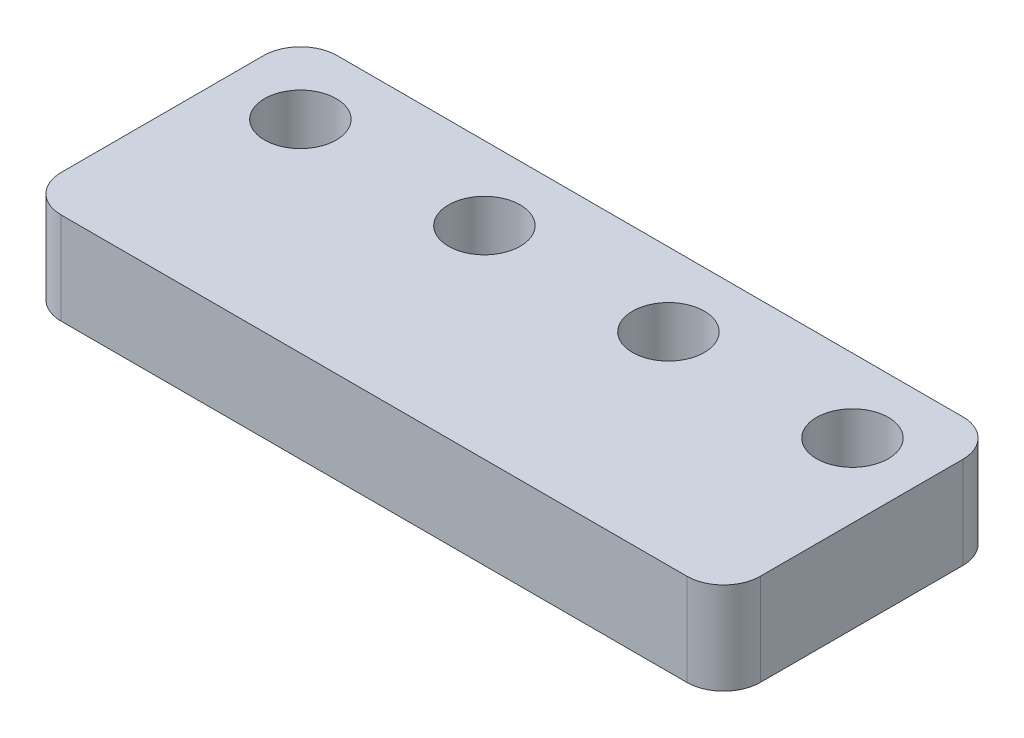
ISO-10303-21;
HEADER;
FILE_DESCRIPTION(('STEP AP214'),'2;1');
FILE_NAME('part.step','',(''),(''),'','','');
FILE_SCHEMA(('AUTOMOTIVE_DESIGN { 1 0 10303 214 1 1 1 1 }'));
ENDSEC;
DATA;
#1=APPLICATION_CONTEXT('core data for automotive mechanical design processes');
#2=APPLICATION_PROTOCOL_DEFINITION('international standard','automotive_design',2000,#1);
#3=PRODUCT_CONTEXT('',#1,'mechanical');
#4=PRODUCT('Part','Part','',(#3));
#5=PRODUCT_RELATED_PRODUCT_CATEGORY('part','',(#4));
#6=PRODUCT_DEFINITION_FORMATION('','',#4);
#7=PRODUCT_DEFINITION_CONTEXT('part definition',#1,'design');
#8=PRODUCT_DEFINITION('design','',#6,#7);
#9=PRODUCT_DEFINITION_SHAPE('','',#8);
#10=(LENGTH_UNIT() NAMED_UNIT(*) SI_UNIT(.MILLI.,.METRE.));
#11=(NAMED_UNIT(*) PLANE_ANGLE_UNIT() SI_UNIT($,.RADIAN.));
#12=(NAMED_UNIT(*) SI_UNIT($,.STERADIAN.) SOLID_ANGLE_UNIT());
#13=UNCERTAINTY_MEASURE_WITH_UNIT(LENGTH_MEASURE(1.E-05),#10,'distance_accuracy_value','');
#14=(GEOMETRIC_REPRESENTATION_CONTEXT(3) GLOBAL_UNCERTAINTY_ASSIGNED_CONTEXT((#13)) GLOBAL_UNIT_ASSIGNED_CONTEXT((#10,
#11,#12)) REPRESENTATION_CONTEXT('',''));
#15=CARTESIAN_POINT('',(0.,0.,0.));
#16=DIRECTION('',(0.,0.,1.));
#17=DIRECTION('',(1.,0.,0.));
#18=AXIS2_PLACEMENT_3D('',#15,#16,#17);
#19=CARTESIAN_POINT('',(-2.,5.,13.));
#20=DIRECTION('',(0.,-1.,0.));
#21=DIRECTION('',(0.,0.,-1.));
#22=AXIS2_PLACEMENT_3D('',#19,#20,#21);
#23=CYLINDRICAL_SURFACE('',#22,2.);
#24=CARTESIAN_POINT('',(-2.,0.,13.));
#25=DIRECTION('',(0.,1.,0.));
#26=DIRECTION('',(0.,0.,1.));
#27=AXIS2_PLACEMENT_3D('',#24,#25,#26);
#28=CIRCLE('',#27,2.);
#29=CARTESIAN_POINT('',(-2.,0.,15.));
#30=VERTEX_POINT('',#29);
#31=CARTESIAN_POINT('',(0.,0.,13.));
#32=VERTEX_POINT('',#31);
#33=EDGE_CURVE('E129',#30,#32,#28,.T.);
#34=ORIENTED_EDGE('',*,*,#33,.T.);
#35=DIRECTION('',(0.,-1.,0.));
#36=VECTOR('',#35,1.);
#37=CARTESIAN_POINT('',(0.,5.,13.));
#38=LINE('',#37,#36);
#39=CARTESIAN_POINT('',(0.,5.,13.));
#40=VERTEX_POINT('',#39);
#41=EDGE_CURVE('E11',#40,#32,#38,.T.);
#42=ORIENTED_EDGE('',*,*,#41,.F.);
#43=CARTESIAN_POINT('',(-2.,5.,13.));
#44=DIRECTION('',(0.,1.,0.));
#45=DIRECTION('',(0.,0.,1.));
#46=AXIS2_PLACEMENT_3D('',#43,#44,#45);
#47=CIRCLE('',#46,2.);
#48=CARTESIAN_POINT('',(-2.,5.,15.));
#49=VERTEX_POINT('',#48);
#50=EDGE_CURVE('E144',#49,#40,#47,.T.);
#51=ORIENTED_EDGE('',*,*,#50,.F.);
#52=DIRECTION('',(0.,-1.,0.));
#53=VECTOR('',#52,1.);
#54=CARTESIAN_POINT('',(-2.,5.,15.));
#55=LINE('',#54,#53);
#56=EDGE_CURVE('E125',#49,#30,#55,.T.);
#57=ORIENTED_EDGE('',*,*,#56,.T.);
#58=EDGE_LOOP('',(#34,#42,#51,#57));
#59=FACE_BOUND('',#58,.T.);
#60=ADVANCED_FACE('F33',(#59),#23,.T.);
#61=CARTESIAN_POINT('',(0.,5.,2.));
#62=DIRECTION('',(-1.,0.,0.));
#63=DIRECTION('',(0.,0.,1.));
#64=AXIS2_PLACEMENT_3D('',#61,#62,#63);
#65=PLANE('',#64);
#66=DIRECTION('',(0.,0.,-1.));
#67=VECTOR('',#66,1.);
#68=CARTESIAN_POINT('',(0.,0.,2.));
#69=LINE('',#68,#67);
#70=CARTESIAN_POINT('',(0.,0.,2.));
#71=VERTEX_POINT('',#70);
#72=EDGE_CURVE('E132',#32,#71,#69,.T.);
#73=ORIENTED_EDGE('',*,*,#72,.T.);
#74=DIRECTION('',(0.,-1.,0.));
#75=VECTOR('',#74,1.);
#76=CARTESIAN_POINT('',(0.,5.,2.));
#77=LINE('',#76,#75);
#78=CARTESIAN_POINT('',(0.,5.,2.));
#79=VERTEX_POINT('',#78);
#80=EDGE_CURVE('E41',#79,#71,#77,.T.);
#81=ORIENTED_EDGE('',*,*,#80,.F.);
#82=DIRECTION('',(0.,0.,-1.));
#83=VECTOR('',#82,1.);
#84=CARTESIAN_POINT('',(0.,5.,2.));
#85=LINE('',#84,#83);
#86=EDGE_CURVE('E92',#40,#79,#85,.T.);
#87=ORIENTED_EDGE('',*,*,#86,.F.);
#88=ORIENTED_EDGE('',*,*,#41,.T.);
#89=EDGE_LOOP('',(#73,#81,#87,#88));
#90=FACE_BOUND('',#89,.T.);
#91=ADVANCED_FACE('F235',(#90),#65,.F.);
#92=CARTESIAN_POINT('',(-2.,5.,2.));
#93=DIRECTION('',(0.,-1.,0.));
#94=DIRECTION('',(0.,0.,-1.));
#95=AXIS2_PLACEMENT_3D('',#92,#93,#94);
#96=CYLINDRICAL_SURFACE('',#95,2.);
#97=CARTESIAN_POINT('',(-2.,0.,2.));
#98=DIRECTION('',(0.,1.,0.));
#99=DIRECTION('',(0.,0.,-1.));
#100=AXIS2_PLACEMENT_3D('',#97,#98,#99);
#101=CIRCLE('',#100,2.);
#102=CARTESIAN_POINT('',(-2.,0.,0.));
#103=VERTEX_POINT('',#102);
#104=EDGE_CURVE('E135',#71,#103,#101,.T.);
#105=ORIENTED_EDGE('',*,*,#104,.T.);
#106=DIRECTION('',(0.,-1.,0.));
#107=VECTOR('',#106,1.);
#108=CARTESIAN_POINT('',(-2.,5.,0.));
#109=LINE('',#108,#107);
#110=CARTESIAN_POINT('',(-2.,5.,0.));
#111=VERTEX_POINT('',#110);
#112=EDGE_CURVE('E151',#111,#103,#109,.T.);
#113=ORIENTED_EDGE('',*,*,#112,.F.);
#114=CARTESIAN_POINT('',(-2.,5.,2.));
#115=DIRECTION('',(0.,1.,0.));
#116=DIRECTION('',(0.,0.,-1.));
#117=AXIS2_PLACEMENT_3D('',#114,#115,#116);
#118=CIRCLE('',#117,2.);
#119=EDGE_CURVE('E159',#79,#111,#118,.T.);
#120=ORIENTED_EDGE('',*,*,#119,.F.);
#121=ORIENTED_EDGE('',*,*,#80,.T.);
#122=EDGE_LOOP('',(#105,#113,#120,#121));
#123=FACE_BOUND('',#122,.T.);
#124=ADVANCED_FACE('F157',(#123),#96,.T.);
#125=CARTESIAN_POINT('',(-36.,5.,0.));
#126=DIRECTION('',(0.,0.,1.));
#127=DIRECTION('',(1.,0.,0.));
#128=AXIS2_PLACEMENT_3D('',#125,#126,#127);
#129=PLANE('',#128);
#130=DIRECTION('',(-1.,0.,0.));
#131=VECTOR('',#130,1.);
#132=CARTESIAN_POINT('',(-36.,0.,0.));
#133=LINE('',#132,#131);
#134=CARTESIAN_POINT('',(-36.,0.,0.));
#135=VERTEX_POINT('',#134);
#136=EDGE_CURVE('E137',#103,#135,#133,.T.);
#137=ORIENTED_EDGE('',*,*,#136,.T.);
#138=DIRECTION('',(0.,-1.,0.));
#139=VECTOR('',#138,1.);
#140=CARTESIAN_POINT('',(-36.,5.,0.));
#141=LINE('',#140,#139);
#142=CARTESIAN_POINT('',(-36.,5.,0.));
#143=VERTEX_POINT('',#142);
#144=EDGE_CURVE('E148',#143,#135,#141,.T.);
#145=ORIENTED_EDGE('',*,*,#144,.F.);
#146=DIRECTION('',(-1.,0.,0.));
#147=VECTOR('',#146,1.);
#148=CARTESIAN_POINT('',(-36.,5.,0.));
#149=LINE('',#148,#147);
#150=EDGE_CURVE('E171',#111,#143,#149,.T.);
#151=ORIENTED_EDGE('',*,*,#150,.F.);
#152=ORIENTED_EDGE('',*,*,#112,.T.);
#153=EDGE_LOOP('',(#137,#145,#151,#152));
#154=FACE_BOUND('',#153,.T.);
#155=ADVANCED_FACE('F167',(#154),#129,.F.);
#156=CARTESIAN_POINT('',(-36.,5.,2.));
#157=DIRECTION('',(0.,-1.,0.));
#158=DIRECTION('',(0.,0.,-1.));
#159=AXIS2_PLACEMENT_3D('',#156,#157,#158);
#160=CYLINDRICAL_SURFACE('',#159,2.);
#161=CARTESIAN_POINT('',(-36.,0.,2.));
#162=DIRECTION('',(0.,1.,0.));
#163=DIRECTION('',(0.,0.,1.));
#164=AXIS2_PLACEMENT_3D('',#161,#162,#163);
#165=CIRCLE('',#164,2.);
#166=CARTESIAN_POINT('',(-38.,0.,2.));
#167=VERTEX_POINT('',#166);
#168=EDGE_CURVE('E139',#135,#167,#165,.T.);
#169=ORIENTED_EDGE('',*,*,#168,.T.);
#170=DIRECTION('',(0.,-1.,0.));
#171=VECTOR('',#170,1.);
#172=CARTESIAN_POINT('',(-38.,5.,2.));
#173=LINE('',#172,#171);
#174=CARTESIAN_POINT('',(-38.,5.,2.));
#175=VERTEX_POINT('',#174);
#176=EDGE_CURVE('E120',#175,#167,#173,.T.);
#177=ORIENTED_EDGE('',*,*,#176,.F.);
#178=CARTESIAN_POINT('',(-36.,5.,2.));
#179=DIRECTION('',(0.,1.,0.));
#180=DIRECTION('',(0.,0.,1.));
#181=AXIS2_PLACEMENT_3D('',#178,#179,#180);
#182=CIRCLE('',#181,2.);
#183=EDGE_CURVE('E111',#143,#175,#182,.T.);
#184=ORIENTED_EDGE('',*,*,#183,.F.);
#185=ORIENTED_EDGE('',*,*,#144,.T.);
#186=EDGE_LOOP('',(#169,#177,#184,#185));
#187=FACE_BOUND('',#186,.T.);
#188=ADVANCED_FACE('F170',(#187),#160,.T.);
#189=CARTESIAN_POINT('',(-38.,5.,2.));
#190=DIRECTION('',(1.,0.,0.));
#191=DIRECTION('',(0.,0.,-1.));
#192=AXIS2_PLACEMENT_3D('',#189,#190,#191);
#193=PLANE('',#192);
#194=DIRECTION('',(0.,0.,1.));
#195=VECTOR('',#194,1.);
#196=CARTESIAN_POINT('',(-38.,0.,2.));
#197=LINE('',#196,#195);
#198=CARTESIAN_POINT('',(-38.,0.,13.));
#199=VERTEX_POINT('',#198);
#200=EDGE_CURVE('E119',#167,#199,#197,.T.);
#201=ORIENTED_EDGE('',*,*,#200,.T.);
#202=DIRECTION('',(0.,-1.,0.));
#203=VECTOR('',#202,1.);
#204=CARTESIAN_POINT('',(-38.,5.,13.));
#205=LINE('',#204,#203);
#206=CARTESIAN_POINT('',(-38.,5.,13.));
#207=VERTEX_POINT('',#206);
#208=EDGE_CURVE('E116',#207,#199,#205,.T.);
#209=ORIENTED_EDGE('',*,*,#208,.F.);
#210=DIRECTION('',(0.,0.,1.));
#211=VECTOR('',#210,1.);
#212=CARTESIAN_POINT('',(-38.,5.,2.));
#213=LINE('',#212,#211);
#214=EDGE_CURVE('E105',#175,#207,#213,.T.);
#215=ORIENTED_EDGE('',*,*,#214,.F.);
#216=ORIENTED_EDGE('',*,*,#176,.T.);
#217=EDGE_LOOP('',(#201,#209,#215,#216));
#218=FACE_BOUND('',#217,.T.);
#219=ADVANCED_FACE('F117',(#218),#193,.F.);
#220=CARTESIAN_POINT('',(-36.,5.,13.));
#221=DIRECTION('',(0.,-1.,0.));
#222=DIRECTION('',(0.,0.,-1.));
#223=AXIS2_PLACEMENT_3D('',#220,#221,#222);
#224=CYLINDRICAL_SURFACE('',#223,2.);
#225=CARTESIAN_POINT('',(-36.,0.,13.));
#226=DIRECTION('',(0.,1.,0.));
#227=DIRECTION('',(0.,0.,1.));
#228=AXIS2_PLACEMENT_3D('',#225,#226,#227);
#229=CIRCLE('',#228,2.);
#230=CARTESIAN_POINT('',(-36.,0.,15.));
#231=VERTEX_POINT('',#230);
#232=EDGE_CURVE('E78',#199,#231,#229,.T.);
#233=ORIENTED_EDGE('',*,*,#232,.T.);
#234=DIRECTION('',(0.,-1.,0.));
#235=VECTOR('',#234,1.);
#236=CARTESIAN_POINT('',(-36.,5.,15.));
#237=LINE('',#236,#235);
#238=CARTESIAN_POINT('',(-36.,5.,15.));
#239=VERTEX_POINT('',#238);
#240=EDGE_CURVE('E121',#239,#231,#237,.T.);
#241=ORIENTED_EDGE('',*,*,#240,.F.);
#242=CARTESIAN_POINT('',(-36.,5.,13.));
#243=DIRECTION('',(0.,1.,0.));
#244=DIRECTION('',(0.,0.,1.));
#245=AXIS2_PLACEMENT_3D('',#242,#243,#244);
#246=CIRCLE('',#245,2.);
#247=EDGE_CURVE('E109',#207,#239,#246,.T.);
#248=ORIENTED_EDGE('',*,*,#247,.F.);
#249=ORIENTED_EDGE('',*,*,#208,.T.);
#250=EDGE_LOOP('',(#233,#241,#248,#249));
#251=FACE_BOUND('',#250,.T.);
#252=ADVANCED_FACE('F123',(#251),#224,.T.);
#253=CARTESIAN_POINT('',(-36.,5.,15.));
#254=DIRECTION('',(0.,0.,-1.));
#255=DIRECTION('',(-1.,0.,0.));
#256=AXIS2_PLACEMENT_3D('',#253,#254,#255);
#257=PLANE('',#256);
#258=DIRECTION('',(1.,0.,0.));
#259=VECTOR('',#258,1.);
#260=CARTESIAN_POINT('',(-36.,0.,15.));
#261=LINE('',#260,#259);
#262=EDGE_CURVE('E84',#231,#30,#261,.T.);
#263=ORIENTED_EDGE('',*,*,#262,.T.);
#264=ORIENTED_EDGE('',*,*,#56,.F.);
#265=DIRECTION('',(1.,0.,0.));
#266=VECTOR('',#265,1.);
#267=CARTESIAN_POINT('',(-36.,5.,15.));
#268=LINE('',#267,#266);
#269=EDGE_CURVE('E49',#239,#49,#268,.T.);
#270=ORIENTED_EDGE('',*,*,#269,.F.);
#271=ORIENTED_EDGE('',*,*,#240,.T.);
#272=EDGE_LOOP('',(#263,#264,#270,#271));
#273=FACE_BOUND('',#272,.T.);
#274=ADVANCED_FACE('F212',(#273),#257,.F.);
#275=CARTESIAN_POINT('',(-2.,5.,13.));
#276=DIRECTION('',(0.,1.,0.));
#277=DIRECTION('',(0.,0.,1.));
#278=AXIS2_PLACEMENT_3D('',#275,#276,#277);
#279=PLANE('',#278);
#280=CARTESIAN_POINT('',(-4.,5.,4.));
#281=DIRECTION('',(0.,1.,0.));
#282=DIRECTION('',(0.,0.,1.));
#283=AXIS2_PLACEMENT_3D('',#280,#281,#282);
#284=CIRCLE('',#283,1.95);
#285=CARTESIAN_POINT('',(-4.,5.,5.95));
#286=VERTEX_POINT('',#285);
#287=EDGE_CURVE('E190',#286,#286,#284,.T.);
#288=ORIENTED_EDGE('',*,*,#287,.F.);
#289=EDGE_LOOP('',(#288));
#290=FACE_BOUND('',#289,.T.);
#291=CARTESIAN_POINT('',(-34.,5.,4.));
#292=DIRECTION('',(0.,1.,0.));
#293=DIRECTION('',(0.,0.,1.));
#294=AXIS2_PLACEMENT_3D('',#291,#292,#293);
#295=CIRCLE('',#294,1.95);
#296=CARTESIAN_POINT('',(-34.,5.,5.95));
#297=VERTEX_POINT('',#296);
#298=EDGE_CURVE('E191',#297,#297,#295,.T.);
#299=ORIENTED_EDGE('',*,*,#298,.F.);
#300=EDGE_LOOP('',(#299));
#301=FACE_BOUND('',#300,.T.);
#302=CARTESIAN_POINT('',(-24.,5.,4.));
#303=DIRECTION('',(0.,1.,0.));
#304=DIRECTION('',(0.,0.,1.));
#305=AXIS2_PLACEMENT_3D('',#302,#303,#304);
#306=CIRCLE('',#305,1.95);
#307=CARTESIAN_POINT('',(-24.,5.,5.95));
#308=VERTEX_POINT('',#307);
#309=EDGE_CURVE('E177',#308,#308,#306,.T.);
#310=ORIENTED_EDGE('',*,*,#309,.F.);
#311=EDGE_LOOP('',(#310));
#312=FACE_BOUND('',#311,.T.);
#313=CARTESIAN_POINT('',(-14.,5.,4.));
#314=DIRECTION('',(0.,1.,0.));
#315=DIRECTION('',(0.,0.,1.));
#316=AXIS2_PLACEMENT_3D('',#313,#314,#315);
#317=CIRCLE('',#316,1.95);
#318=CARTESIAN_POINT('',(-14.,5.,5.95));
#319=VERTEX_POINT('',#318);
#320=EDGE_CURVE('E184',#319,#319,#317,.T.);
#321=ORIENTED_EDGE('',*,*,#320,.F.);
#322=EDGE_LOOP('',(#321));
#323=FACE_BOUND('',#322,.T.);
#324=ORIENTED_EDGE('',*,*,#50,.T.);
#325=ORIENTED_EDGE('',*,*,#86,.T.);
#326=ORIENTED_EDGE('',*,*,#119,.T.);
#327=ORIENTED_EDGE('',*,*,#150,.T.);
#328=ORIENTED_EDGE('',*,*,#183,.T.);
#329=ORIENTED_EDGE('',*,*,#214,.T.);
#330=ORIENTED_EDGE('',*,*,#247,.T.);
#331=ORIENTED_EDGE('',*,*,#269,.T.);
#332=EDGE_LOOP('',(#324,#325,#326,#327,#328,#329,#330,#331));
#333=FACE_BOUND('',#332,.T.);
#334=ADVANCED_FACE('F107',(#290,#301,#312,#323,#333),#279,.T.);
#335=CARTESIAN_POINT('',(-2.,0.,13.));
#336=DIRECTION('',(0.,1.,0.));
#337=DIRECTION('',(0.,0.,1.));
#338=AXIS2_PLACEMENT_3D('',#335,#336,#337);
#339=PLANE('',#338);
#340=CARTESIAN_POINT('',(-4.,0.,4.));
#341=DIRECTION('',(0.,1.,0.));
#342=DIRECTION('',(0.,0.,1.));
#343=AXIS2_PLACEMENT_3D('',#340,#341,#342);
#344=CIRCLE('',#343,1.95);
#345=CARTESIAN_POINT('',(-4.,0.,5.95));
#346=VERTEX_POINT('',#345);
#347=EDGE_CURVE('E133',#346,#346,#344,.T.);
#348=ORIENTED_EDGE('',*,*,#347,.T.);
#349=EDGE_LOOP('',(#348));
#350=FACE_BOUND('',#349,.T.);
#351=CARTESIAN_POINT('',(-34.,0.,4.));
#352=DIRECTION('',(0.,1.,0.));
#353=DIRECTION('',(0.,0.,1.));
#354=AXIS2_PLACEMENT_3D('',#351,#352,#353);
#355=CIRCLE('',#354,1.95);
#356=CARTESIAN_POINT('',(-34.,0.,5.95));
#357=VERTEX_POINT('',#356);
#358=EDGE_CURVE('E181',#357,#357,#355,.T.);
#359=ORIENTED_EDGE('',*,*,#358,.T.);
#360=EDGE_LOOP('',(#359));
#361=FACE_BOUND('',#360,.T.);
#362=CARTESIAN_POINT('',(-24.,0.,4.));
#363=DIRECTION('',(0.,1.,0.));
#364=DIRECTION('',(0.,0.,1.));
#365=AXIS2_PLACEMENT_3D('',#362,#363,#364);
#366=CIRCLE('',#365,1.95);
#367=CARTESIAN_POINT('',(-24.,0.,5.95));
#368=VERTEX_POINT('',#367);
#369=EDGE_CURVE('E180',#368,#368,#366,.T.);
#370=ORIENTED_EDGE('',*,*,#369,.T.);
#371=EDGE_LOOP('',(#370));
#372=FACE_BOUND('',#371,.T.);
#373=CARTESIAN_POINT('',(-14.,0.,4.));
#374=DIRECTION('',(0.,1.,0.));
#375=DIRECTION('',(0.,0.,1.));
#376=AXIS2_PLACEMENT_3D('',#373,#374,#375);
#377=CIRCLE('',#376,1.95);
#378=CARTESIAN_POINT('',(-14.,0.,5.95));
#379=VERTEX_POINT('',#378);
#380=EDGE_CURVE('E187',#379,#379,#377,.T.);
#381=ORIENTED_EDGE('',*,*,#380,.T.);
#382=EDGE_LOOP('',(#381));
#383=FACE_BOUND('',#382,.T.);
#384=ORIENTED_EDGE('',*,*,#33,.F.);
#385=ORIENTED_EDGE('',*,*,#262,.F.);
#386=ORIENTED_EDGE('',*,*,#232,.F.);
#387=ORIENTED_EDGE('',*,*,#200,.F.);
#388=ORIENTED_EDGE('',*,*,#168,.F.);
#389=ORIENTED_EDGE('',*,*,#136,.F.);
#390=ORIENTED_EDGE('',*,*,#104,.F.);
#391=ORIENTED_EDGE('',*,*,#72,.F.);
#392=EDGE_LOOP('',(#384,#385,#386,#387,#388,#389,#390,#391));
#393=FACE_BOUND('',#392,.T.);
#394=ADVANCED_FACE('F163',(#350,#361,#372,#383,#393),#339,.F.);
#395=CARTESIAN_POINT('',(-14.,0.,4.));
#396=DIRECTION('',(0.,1.,0.));
#397=DIRECTION('',(0.,0.,1.));
#398=AXIS2_PLACEMENT_3D('',#395,#396,#397);
#399=CYLINDRICAL_SURFACE('',#398,1.95);
#400=ORIENTED_EDGE('',*,*,#380,.F.);
#401=EDGE_LOOP('',(#400));
#402=FACE_BOUND('',#401,.T.);
#403=ORIENTED_EDGE('',*,*,#320,.T.);
#404=EDGE_LOOP('',(#403));
#405=FACE_BOUND('',#404,.T.);
#406=ADVANCED_FACE('F220',(#402,#405),#399,.F.);
#407=CARTESIAN_POINT('',(-24.,0.,4.));
#408=DIRECTION('',(0.,1.,0.));
#409=DIRECTION('',(0.,0.,1.));
#410=AXIS2_PLACEMENT_3D('',#407,#408,#409);
#411=CYLINDRICAL_SURFACE('',#410,1.95);
#412=ORIENTED_EDGE('',*,*,#369,.F.);
#413=EDGE_LOOP('',(#412));
#414=FACE_BOUND('',#413,.T.);
#415=ORIENTED_EDGE('',*,*,#309,.T.);
#416=EDGE_LOOP('',(#415));
#417=FACE_BOUND('',#416,.T.);
#418=ADVANCED_FACE('F222',(#414,#417),#411,.F.);
#419=CARTESIAN_POINT('',(-34.,0.,4.));
#420=DIRECTION('',(0.,1.,0.));
#421=DIRECTION('',(0.,0.,1.));
#422=AXIS2_PLACEMENT_3D('',#419,#420,#421);
#423=CYLINDRICAL_SURFACE('',#422,1.95);
#424=ORIENTED_EDGE('',*,*,#358,.F.);
#425=EDGE_LOOP('',(#424));
#426=FACE_BOUND('',#425,.T.);
#427=ORIENTED_EDGE('',*,*,#298,.T.);
#428=EDGE_LOOP('',(#427));
#429=FACE_BOUND('',#428,.T.);
#430=ADVANCED_FACE('F206',(#426,#429),#423,.F.);
#431=CARTESIAN_POINT('',(-4.,0.,4.));
#432=DIRECTION('',(0.,1.,0.));
#433=DIRECTION('',(0.,0.,1.));
#434=AXIS2_PLACEMENT_3D('',#431,#432,#433);
#435=CYLINDRICAL_SURFACE('',#434,1.95);
#436=ORIENTED_EDGE('',*,*,#347,.F.);
#437=EDGE_LOOP('',(#436));
#438=FACE_BOUND('',#437,.T.);
#439=ORIENTED_EDGE('',*,*,#287,.T.);
#440=EDGE_LOOP('',(#439));
#441=FACE_BOUND('',#440,.T.);
#442=ADVANCED_FACE('F203',(#438,#441),#435,.F.);
#443=CLOSED_SHELL('',(#60,#91,#124,#155,#188,#219,#252,#274,#334,#394,#406,#418,#430,#442));
#444=MANIFOLD_SOLID_BREP('B2',#443);
#445=ADVANCED_BREP_SHAPE_REPRESENTATION('',(#18,#444),#14);
#446=SHAPE_DEFINITION_REPRESENTATION(#9,#445);
ENDSEC;
END-ISO-10303-21;
